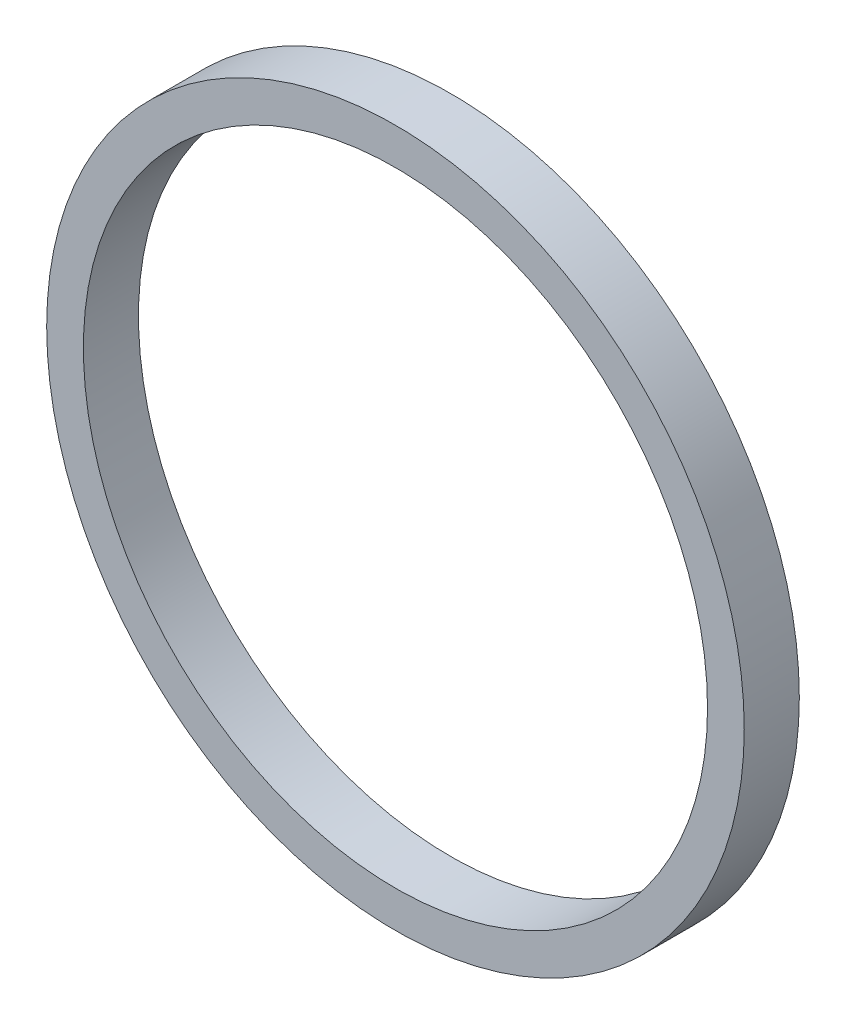
ISO-10303-21;
HEADER;
FILE_DESCRIPTION(('STEP AP214'),'2;1');
FILE_NAME('part.step','',(''),(''),'','','');
FILE_SCHEMA(('AUTOMOTIVE_DESIGN { 1 0 10303 214 1 1 1 1 }'));
ENDSEC;
DATA;
#1=APPLICATION_CONTEXT('core data for automotive mechanical design processes');
#2=APPLICATION_PROTOCOL_DEFINITION('international standard','automotive_design',2000,#1);
#3=PRODUCT_CONTEXT('',#1,'mechanical');
#4=PRODUCT('Part','Part','',(#3));
#5=PRODUCT_RELATED_PRODUCT_CATEGORY('part','',(#4));
#6=PRODUCT_DEFINITION_FORMATION('','',#4);
#7=PRODUCT_DEFINITION_CONTEXT('part definition',#1,'design');
#8=PRODUCT_DEFINITION('design','',#6,#7);
#9=PRODUCT_DEFINITION_SHAPE('','',#8);
#10=(LENGTH_UNIT() NAMED_UNIT(*) SI_UNIT(.MILLI.,.METRE.));
#11=(NAMED_UNIT(*) PLANE_ANGLE_UNIT() SI_UNIT($,.RADIAN.));
#12=(NAMED_UNIT(*) SI_UNIT($,.STERADIAN.) SOLID_ANGLE_UNIT());
#13=UNCERTAINTY_MEASURE_WITH_UNIT(LENGTH_MEASURE(1.E-05),#10,'distance_accuracy_value','');
#14=(GEOMETRIC_REPRESENTATION_CONTEXT(3) GLOBAL_UNCERTAINTY_ASSIGNED_CONTEXT((#13)) GLOBAL_UNIT_ASSIGNED_CONTEXT((#10,
#11,#12)) REPRESENTATION_CONTEXT('',''));
#15=CARTESIAN_POINT('',(0.,0.,0.));
#16=DIRECTION('',(0.,0.,1.));
#17=DIRECTION('',(1.,0.,0.));
#18=AXIS2_PLACEMENT_3D('',#15,#16,#17);
#19=CARTESIAN_POINT('',(0.,0.,1.5));
#20=DIRECTION('',(0.,0.,1.));
#21=DIRECTION('',(1.,0.,0.));
#22=AXIS2_PLACEMENT_3D('',#19,#20,#21);
#23=PLANE('',#22);
#24=CARTESIAN_POINT('',(0.,0.,1.5));
#25=DIRECTION('',(0.,0.,1.));
#26=DIRECTION('',(1.,0.,0.));
#27=AXIS2_PLACEMENT_3D('',#24,#25,#26);
#28=CIRCLE('',#27,9.5);
#29=CARTESIAN_POINT('',(9.5,0.,1.5));
#30=VERTEX_POINT('',#29);
#31=EDGE_CURVE('E10',#30,#30,#28,.T.);
#32=ORIENTED_EDGE('',*,*,#31,.T.);
#33=EDGE_LOOP('',(#32));
#34=FACE_BOUND('',#33,.T.);
#35=CARTESIAN_POINT('',(0.,0.,1.5));
#36=DIRECTION('',(0.,0.,1.));
#37=DIRECTION('',(1.,0.,0.));
#38=AXIS2_PLACEMENT_3D('',#35,#36,#37);
#39=CIRCLE('',#38,8.5);
#40=CARTESIAN_POINT('',(8.5,0.,1.5));
#41=VERTEX_POINT('',#40);
#42=EDGE_CURVE('E48',#41,#41,#39,.T.);
#43=ORIENTED_EDGE('',*,*,#42,.F.);
#44=EDGE_LOOP('',(#43));
#45=FACE_BOUND('',#44,.T.);
#46=ADVANCED_FACE('F37',(#34,#45),#23,.T.);
#47=CARTESIAN_POINT('',(0.,0.,0.));
#48=DIRECTION('',(0.,0.,1.));
#49=DIRECTION('',(1.,0.,0.));
#50=AXIS2_PLACEMENT_3D('',#47,#48,#49);
#51=PLANE('',#50);
#52=CARTESIAN_POINT('',(0.,0.,0.));
#53=DIRECTION('',(0.,0.,1.));
#54=DIRECTION('',(1.,0.,0.));
#55=AXIS2_PLACEMENT_3D('',#52,#53,#54);
#56=CIRCLE('',#55,9.5);
#57=CARTESIAN_POINT('',(9.5,0.,0.));
#58=VERTEX_POINT('',#57);
#59=EDGE_CURVE('E41',#58,#58,#56,.T.);
#60=ORIENTED_EDGE('',*,*,#59,.F.);
#61=EDGE_LOOP('',(#60));
#62=FACE_BOUND('',#61,.T.);
#63=CARTESIAN_POINT('',(0.,0.,0.));
#64=DIRECTION('',(0.,0.,1.));
#65=DIRECTION('',(1.,0.,0.));
#66=AXIS2_PLACEMENT_3D('',#63,#64,#65);
#67=CIRCLE('',#66,8.5);
#68=CARTESIAN_POINT('',(8.5,0.,0.));
#69=VERTEX_POINT('',#68);
#70=EDGE_CURVE('E50',#69,#69,#67,.T.);
#71=ORIENTED_EDGE('',*,*,#70,.T.);
#72=EDGE_LOOP('',(#71));
#73=FACE_BOUND('',#72,.T.);
#74=ADVANCED_FACE('F60',(#62,#73),#51,.F.);
#75=CARTESIAN_POINT('',(0.,0.,1.5));
#76=DIRECTION('',(0.,0.,-1.));
#77=DIRECTION('',(-1.,0.,0.));
#78=AXIS2_PLACEMENT_3D('',#75,#76,#77);
#79=CYLINDRICAL_SURFACE('',#78,9.5);
#80=ORIENTED_EDGE('',*,*,#31,.F.);
#81=EDGE_LOOP('',(#80));
#82=FACE_BOUND('',#81,.T.);
#83=ORIENTED_EDGE('',*,*,#59,.T.);
#84=EDGE_LOOP('',(#83));
#85=FACE_BOUND('',#84,.T.);
#86=ADVANCED_FACE('F39',(#82,#85),#79,.T.);
#87=CARTESIAN_POINT('',(0.,0.,1.5));
#88=DIRECTION('',(0.,0.,-1.));
#89=DIRECTION('',(-1.,0.,0.));
#90=AXIS2_PLACEMENT_3D('',#87,#88,#89);
#91=CYLINDRICAL_SURFACE('',#90,8.5);
#92=ORIENTED_EDGE('',*,*,#42,.T.);
#93=EDGE_LOOP('',(#92));
#94=FACE_BOUND('',#93,.T.);
#95=ORIENTED_EDGE('',*,*,#70,.F.);
#96=EDGE_LOOP('',(#95));
#97=FACE_BOUND('',#96,.T.);
#98=ADVANCED_FACE('F56',(#94,#97),#91,.F.);
#99=CLOSED_SHELL('',(#46,#74,#86,#98));
#100=MANIFOLD_SOLID_BREP('B2',#99);
#101=ADVANCED_BREP_SHAPE_REPRESENTATION('',(#18,#100),#14);
#102=SHAPE_DEFINITION_REPRESENTATION(#9,#101);
ENDSEC;
END-ISO-10303-21;
